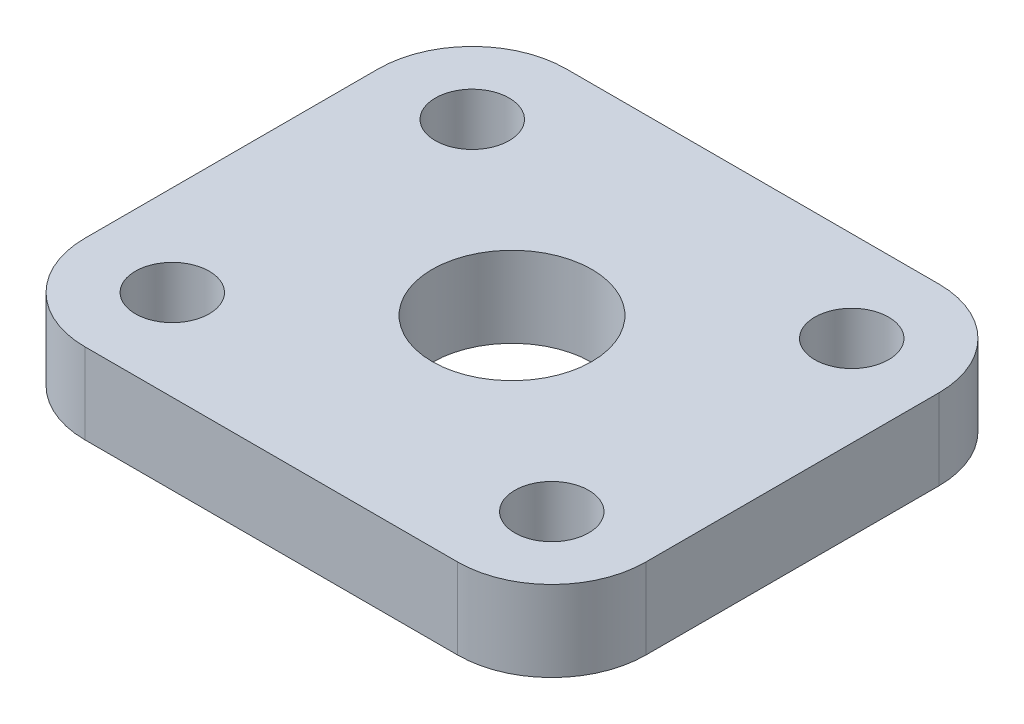
ISO-10303-21;
HEADER;
FILE_DESCRIPTION(('STEP AP214'),'2;1');
FILE_NAME('part.step','',(''),(''),'','','');
FILE_SCHEMA(('AUTOMOTIVE_DESIGN { 1 0 10303 214 1 1 1 1 }'));
ENDSEC;
DATA;
#1=APPLICATION_CONTEXT('core data for automotive mechanical design processes');
#2=APPLICATION_PROTOCOL_DEFINITION('international standard','automotive_design',2000,#1);
#3=PRODUCT_CONTEXT('',#1,'mechanical');
#4=PRODUCT('Part','Part','',(#3));
#5=PRODUCT_RELATED_PRODUCT_CATEGORY('part','',(#4));
#6=PRODUCT_DEFINITION_FORMATION('','',#4);
#7=PRODUCT_DEFINITION_CONTEXT('part definition',#1,'design');
#8=PRODUCT_DEFINITION('design','',#6,#7);
#9=PRODUCT_DEFINITION_SHAPE('','',#8);
#10=(LENGTH_UNIT() NAMED_UNIT(*) SI_UNIT(.MILLI.,.METRE.));
#11=(NAMED_UNIT(*) PLANE_ANGLE_UNIT() SI_UNIT($,.RADIAN.));
#12=(NAMED_UNIT(*) SI_UNIT($,.STERADIAN.) SOLID_ANGLE_UNIT());
#13=UNCERTAINTY_MEASURE_WITH_UNIT(LENGTH_MEASURE(1.E-05),#10,'distance_accuracy_value','');
#14=(GEOMETRIC_REPRESENTATION_CONTEXT(3) GLOBAL_UNCERTAINTY_ASSIGNED_CONTEXT((#13)) GLOBAL_UNIT_ASSIGNED_CONTEXT((#10,
#11,#12)) REPRESENTATION_CONTEXT('',''));
#15=CARTESIAN_POINT('',(0.,0.,0.));
#16=DIRECTION('',(0.,0.,1.));
#17=DIRECTION('',(1.,0.,0.));
#18=AXIS2_PLACEMENT_3D('',#15,#16,#17);
#19=CARTESIAN_POINT('',(20.8710849384369,-6.,0.));
#20=DIRECTION('',(1.,0.,0.));
#21=DIRECTION('',(0.,0.,-1.));
#22=AXIS2_PLACEMENT_3D('',#19,#20,#21);
#23=PLANE('',#22);
#24=DIRECTION('',(0.,0.,-1.));
#25=VECTOR('',#24,1.);
#26=CARTESIAN_POINT('',(20.8710849384369,-6.,0.));
#27=LINE('',#26,#25);
#28=CARTESIAN_POINT('',(20.8710849384369,-6.,10.9122112576967));
#29=VERTEX_POINT('',#28);
#30=CARTESIAN_POINT('',(20.8710849384369,-6.,-10.9122112576967));
#31=VERTEX_POINT('',#30);
#32=EDGE_CURVE('E11',#29,#31,#27,.T.);
#33=ORIENTED_EDGE('',*,*,#32,.T.);
#34=DIRECTION('',(0.,1.,0.));
#35=VECTOR('',#34,1.);
#36=CARTESIAN_POINT('',(20.8710849384369,-6.,-10.9122112576967));
#37=LINE('',#36,#35);
#38=CARTESIAN_POINT('',(20.8710849384369,0.,-10.9122112576967));
#39=VERTEX_POINT('',#38);
#40=EDGE_CURVE('E23',#31,#39,#37,.T.);
#41=ORIENTED_EDGE('',*,*,#40,.T.);
#42=DIRECTION('',(0.,0.,-1.));
#43=VECTOR('',#42,1.);
#44=CARTESIAN_POINT('',(20.8710849384369,0.,0.));
#45=LINE('',#44,#43);
#46=CARTESIAN_POINT('',(20.8710849384369,0.,10.9122112576967));
#47=VERTEX_POINT('',#46);
#48=EDGE_CURVE('E157',#47,#39,#45,.T.);
#49=ORIENTED_EDGE('',*,*,#48,.F.);
#50=DIRECTION('',(0.,1.,0.));
#51=VECTOR('',#50,1.);
#52=CARTESIAN_POINT('',(20.8710849384369,-6.,10.9122112576967));
#53=LINE('',#52,#51);
#54=EDGE_CURVE('E155',#47,#29,#53,.F.);
#55=ORIENTED_EDGE('',*,*,#54,.T.);
#56=EDGE_LOOP('',(#33,#41,#49,#55));
#57=FACE_BOUND('',#56,.T.);
#58=ADVANCED_FACE('F16',(#57),#23,.T.);
#59=CARTESIAN_POINT('',(0.,-6.,17.9122112576968));
#60=DIRECTION('',(0.,0.,-1.));
#61=DIRECTION('',(-1.,0.,0.));
#62=AXIS2_PLACEMENT_3D('',#59,#60,#61);
#63=PLANE('',#62);
#64=DIRECTION('',(-1.,0.,0.));
#65=VECTOR('',#64,1.);
#66=CARTESIAN_POINT('',(0.,-6.,17.9122112576968));
#67=LINE('',#66,#65);
#68=CARTESIAN_POINT('',(13.8710849384369,-6.,17.9122112576968));
#69=VERTEX_POINT('',#68);
#70=CARTESIAN_POINT('',(-13.8710849384369,-6.,17.9122112576968));
#71=VERTEX_POINT('',#70);
#72=EDGE_CURVE('E152',#69,#71,#67,.T.);
#73=ORIENTED_EDGE('',*,*,#72,.F.);
#74=DIRECTION('',(0.,1.,0.));
#75=VECTOR('',#74,1.);
#76=CARTESIAN_POINT('',(13.8710849384369,0.,17.9122112576968));
#77=LINE('',#76,#75);
#78=CARTESIAN_POINT('',(13.8710849384369,0.,17.9122112576968));
#79=VERTEX_POINT('',#78);
#80=EDGE_CURVE('E150',#69,#79,#77,.T.);
#81=ORIENTED_EDGE('',*,*,#80,.T.);
#82=DIRECTION('',(-1.,0.,0.));
#83=VECTOR('',#82,1.);
#84=CARTESIAN_POINT('',(0.,0.,17.9122112576968));
#85=LINE('',#84,#83);
#86=CARTESIAN_POINT('',(-13.8710849384369,0.,17.9122112576968));
#87=VERTEX_POINT('',#86);
#88=EDGE_CURVE('E148',#79,#87,#85,.T.);
#89=ORIENTED_EDGE('',*,*,#88,.T.);
#90=DIRECTION('',(0.,1.,0.));
#91=VECTOR('',#90,1.);
#92=CARTESIAN_POINT('',(-13.8710849384369,-6.,17.9122112576968));
#93=LINE('',#92,#91);
#94=EDGE_CURVE('E146',#87,#71,#93,.F.);
#95=ORIENTED_EDGE('',*,*,#94,.T.);
#96=EDGE_LOOP('',(#73,#81,#89,#95));
#97=FACE_BOUND('',#96,.T.);
#98=ADVANCED_FACE('F200',(#97),#63,.F.);
#99=CARTESIAN_POINT('',(-20.8710849384369,-6.,0.));
#100=DIRECTION('',(1.,0.,0.));
#101=DIRECTION('',(0.,0.,-1.));
#102=AXIS2_PLACEMENT_3D('',#99,#100,#101);
#103=PLANE('',#102);
#104=DIRECTION('',(0.,0.,-1.));
#105=VECTOR('',#104,1.);
#106=CARTESIAN_POINT('',(-20.8710849384369,0.,0.));
#107=LINE('',#106,#105);
#108=CARTESIAN_POINT('',(-20.8710849384369,0.,10.9122112576967));
#109=VERTEX_POINT('',#108);
#110=CARTESIAN_POINT('',(-20.8710849384369,0.,-10.9122112576967));
#111=VERTEX_POINT('',#110);
#112=EDGE_CURVE('E144',#109,#111,#107,.T.);
#113=ORIENTED_EDGE('',*,*,#112,.T.);
#114=DIRECTION('',(0.,1.,0.));
#115=VECTOR('',#114,1.);
#116=CARTESIAN_POINT('',(-20.8710849384369,-6.,-10.9122112576967));
#117=LINE('',#116,#115);
#118=CARTESIAN_POINT('',(-20.8710849384369,-6.,-10.9122112576967));
#119=VERTEX_POINT('',#118);
#120=EDGE_CURVE('E142',#111,#119,#117,.F.);
#121=ORIENTED_EDGE('',*,*,#120,.T.);
#122=DIRECTION('',(0.,0.,-1.));
#123=VECTOR('',#122,1.);
#124=CARTESIAN_POINT('',(-20.8710849384369,-6.,0.));
#125=LINE('',#124,#123);
#126=CARTESIAN_POINT('',(-20.8710849384369,-6.,10.9122112576967));
#127=VERTEX_POINT('',#126);
#128=EDGE_CURVE('E140',#127,#119,#125,.T.);
#129=ORIENTED_EDGE('',*,*,#128,.F.);
#130=DIRECTION('',(0.,1.,0.));
#131=VECTOR('',#130,1.);
#132=CARTESIAN_POINT('',(-20.8710849384369,-6.,10.9122112576967));
#133=LINE('',#132,#131);
#134=EDGE_CURVE('E138',#127,#109,#133,.T.);
#135=ORIENTED_EDGE('',*,*,#134,.T.);
#136=EDGE_LOOP('',(#113,#121,#129,#135));
#137=FACE_BOUND('',#136,.T.);
#138=ADVANCED_FACE('F184',(#137),#103,.F.);
#139=CARTESIAN_POINT('',(-14.1210849384369,-6.,-11.1622112576967));
#140=DIRECTION('',(0.,1.,0.));
#141=DIRECTION('',(0.,0.,1.));
#142=AXIS2_PLACEMENT_3D('',#139,#140,#141);
#143=CYLINDRICAL_SURFACE('',#142,2.75);
#144=CARTESIAN_POINT('',(-14.1210849384369,-6.,-11.1622112576967));
#145=DIRECTION('',(0.,-1.,0.));
#146=DIRECTION('',(0.,0.,-1.));
#147=AXIS2_PLACEMENT_3D('',#144,#145,#146);
#148=CIRCLE('',#147,2.75);
#149=CARTESIAN_POINT('',(-14.1210849384369,-6.,-13.9122112576967));
#150=VERTEX_POINT('',#149);
#151=EDGE_CURVE('E135',#150,#150,#148,.T.);
#152=ORIENTED_EDGE('',*,*,#151,.T.);
#153=EDGE_LOOP('',(#152));
#154=FACE_BOUND('',#153,.T.);
#155=CARTESIAN_POINT('',(-14.1210849384369,0.,-11.1622112576967));
#156=DIRECTION('',(0.,-1.,0.));
#157=DIRECTION('',(0.,0.,-1.));
#158=AXIS2_PLACEMENT_3D('',#155,#156,#157);
#159=CIRCLE('',#158,2.75);
#160=CARTESIAN_POINT('',(-14.1210849384369,0.,-13.9122112576967));
#161=VERTEX_POINT('',#160);
#162=EDGE_CURVE('E132',#161,#161,#159,.T.);
#163=ORIENTED_EDGE('',*,*,#162,.F.);
#164=EDGE_LOOP('',(#163));
#165=FACE_BOUND('',#164,.T.);
#166=ADVANCED_FACE('F208',(#154,#165),#143,.F.);
#167=CARTESIAN_POINT('',(-14.1210849384369,-6.,11.1622112576967));
#168=DIRECTION('',(0.,1.,0.));
#169=DIRECTION('',(0.,0.,1.));
#170=AXIS2_PLACEMENT_3D('',#167,#168,#169);
#171=CYLINDRICAL_SURFACE('',#170,2.75);
#172=CARTESIAN_POINT('',(-14.1210849384369,-6.,11.1622112576967));
#173=DIRECTION('',(0.,1.,0.));
#174=DIRECTION('',(0.,0.,-1.));
#175=AXIS2_PLACEMENT_3D('',#172,#173,#174);
#176=CIRCLE('',#175,2.75);
#177=CARTESIAN_POINT('',(-14.1210849384369,-6.,8.41221125769674));
#178=VERTEX_POINT('',#177);
#179=EDGE_CURVE('E129',#178,#178,#176,.T.);
#180=ORIENTED_EDGE('',*,*,#179,.F.);
#181=EDGE_LOOP('',(#180));
#182=FACE_BOUND('',#181,.T.);
#183=CARTESIAN_POINT('',(-14.1210849384369,0.,11.1622112576967));
#184=DIRECTION('',(0.,1.,0.));
#185=DIRECTION('',(0.,0.,-1.));
#186=AXIS2_PLACEMENT_3D('',#183,#184,#185);
#187=CIRCLE('',#186,2.75);
#188=CARTESIAN_POINT('',(-14.1210849384369,0.,8.41221125769674));
#189=VERTEX_POINT('',#188);
#190=EDGE_CURVE('E126',#189,#189,#187,.T.);
#191=ORIENTED_EDGE('',*,*,#190,.T.);
#192=EDGE_LOOP('',(#191));
#193=FACE_BOUND('',#192,.T.);
#194=ADVANCED_FACE('F213',(#182,#193),#171,.F.);
#195=CARTESIAN_POINT('',(0.,-6.,0.));
#196=DIRECTION('',(0.,1.,0.));
#197=DIRECTION('',(0.,0.,1.));
#198=AXIS2_PLACEMENT_3D('',#195,#196,#197);
#199=CYLINDRICAL_SURFACE('',#198,5.945);
#200=CARTESIAN_POINT('',(0.,-6.,0.));
#201=DIRECTION('',(0.,-1.,0.));
#202=DIRECTION('',(0.,0.,-1.));
#203=AXIS2_PLACEMENT_3D('',#200,#201,#202);
#204=CIRCLE('',#203,5.945);
#205=CARTESIAN_POINT('',(0.,-6.,-5.945));
#206=VERTEX_POINT('',#205);
#207=EDGE_CURVE('E123',#206,#206,#204,.T.);
#208=ORIENTED_EDGE('',*,*,#207,.T.);
#209=EDGE_LOOP('',(#208));
#210=FACE_BOUND('',#209,.T.);
#211=CARTESIAN_POINT('',(0.,0.,0.));
#212=DIRECTION('',(0.,-1.,0.));
#213=DIRECTION('',(0.,0.,-1.));
#214=AXIS2_PLACEMENT_3D('',#211,#212,#213);
#215=CIRCLE('',#214,5.945);
#216=CARTESIAN_POINT('',(0.,0.,-5.945));
#217=VERTEX_POINT('',#216);
#218=EDGE_CURVE('E120',#217,#217,#215,.T.);
#219=ORIENTED_EDGE('',*,*,#218,.F.);
#220=EDGE_LOOP('',(#219));
#221=FACE_BOUND('',#220,.T.);
#222=ADVANCED_FACE('F217',(#210,#221),#199,.F.);
#223=CARTESIAN_POINT('',(14.1210849384369,-6.,11.1622112576967));
#224=DIRECTION('',(0.,1.,0.));
#225=DIRECTION('',(0.,0.,1.));
#226=AXIS2_PLACEMENT_3D('',#223,#224,#225);
#227=CYLINDRICAL_SURFACE('',#226,2.75);
#228=CARTESIAN_POINT('',(14.1210849384369,-6.,11.1622112576967));
#229=DIRECTION('',(0.,-1.,0.));
#230=DIRECTION('',(0.,0.,-1.));
#231=AXIS2_PLACEMENT_3D('',#228,#229,#230);
#232=CIRCLE('',#231,2.75);
#233=CARTESIAN_POINT('',(14.1210849384369,-6.,8.41221125769674));
#234=VERTEX_POINT('',#233);
#235=EDGE_CURVE('E117',#234,#234,#232,.T.);
#236=ORIENTED_EDGE('',*,*,#235,.T.);
#237=EDGE_LOOP('',(#236));
#238=FACE_BOUND('',#237,.T.);
#239=CARTESIAN_POINT('',(14.1210849384369,0.,11.1622112576967));
#240=DIRECTION('',(0.,-1.,0.));
#241=DIRECTION('',(0.,0.,-1.));
#242=AXIS2_PLACEMENT_3D('',#239,#240,#241);
#243=CIRCLE('',#242,2.75);
#244=CARTESIAN_POINT('',(14.1210849384369,0.,8.41221125769674));
#245=VERTEX_POINT('',#244);
#246=EDGE_CURVE('E96',#245,#245,#243,.T.);
#247=ORIENTED_EDGE('',*,*,#246,.F.);
#248=EDGE_LOOP('',(#247));
#249=FACE_BOUND('',#248,.T.);
#250=ADVANCED_FACE('F221',(#238,#249),#227,.F.);
#251=CARTESIAN_POINT('',(0.,-6.,-17.9122112576968));
#252=DIRECTION('',(0.,0.,-1.));
#253=DIRECTION('',(-1.,0.,0.));
#254=AXIS2_PLACEMENT_3D('',#251,#252,#253);
#255=PLANE('',#254);
#256=DIRECTION('',(-1.,0.,0.));
#257=VECTOR('',#256,1.);
#258=CARTESIAN_POINT('',(0.,-6.,-17.9122112576968));
#259=LINE('',#258,#257);
#260=CARTESIAN_POINT('',(13.8710849384369,-6.,-17.9122112576968));
#261=VERTEX_POINT('',#260);
#262=CARTESIAN_POINT('',(-13.8710849384369,-6.,-17.9122112576968));
#263=VERTEX_POINT('',#262);
#264=EDGE_CURVE('E78',#261,#263,#259,.T.);
#265=ORIENTED_EDGE('',*,*,#264,.T.);
#266=DIRECTION('',(0.,1.,0.));
#267=VECTOR('',#266,1.);
#268=CARTESIAN_POINT('',(-13.8710849384369,0.,-17.9122112576968));
#269=LINE('',#268,#267);
#270=CARTESIAN_POINT('',(-13.8710849384369,0.,-17.9122112576968));
#271=VERTEX_POINT('',#270);
#272=EDGE_CURVE('E97',#263,#271,#269,.T.);
#273=ORIENTED_EDGE('',*,*,#272,.T.);
#274=DIRECTION('',(-1.,0.,0.));
#275=VECTOR('',#274,1.);
#276=CARTESIAN_POINT('',(0.,0.,-17.9122112576968));
#277=LINE('',#276,#275);
#278=CARTESIAN_POINT('',(13.8710849384369,0.,-17.9122112576968));
#279=VERTEX_POINT('',#278);
#280=EDGE_CURVE('E81',#279,#271,#277,.T.);
#281=ORIENTED_EDGE('',*,*,#280,.F.);
#282=DIRECTION('',(0.,1.,0.));
#283=VECTOR('',#282,1.);
#284=CARTESIAN_POINT('',(13.8710849384369,-6.,-17.9122112576968));
#285=LINE('',#284,#283);
#286=EDGE_CURVE('E75',#279,#261,#285,.F.);
#287=ORIENTED_EDGE('',*,*,#286,.T.);
#288=EDGE_LOOP('',(#265,#273,#281,#287));
#289=FACE_BOUND('',#288,.T.);
#290=ADVANCED_FACE('F77',(#289),#255,.T.);
#291=CARTESIAN_POINT('',(14.1210849384369,-6.,-11.1622112576967));
#292=DIRECTION('',(0.,1.,0.));
#293=DIRECTION('',(0.,0.,1.));
#294=AXIS2_PLACEMENT_3D('',#291,#292,#293);
#295=CYLINDRICAL_SURFACE('',#294,2.75);
#296=CARTESIAN_POINT('',(14.1210849384369,-6.,-11.1622112576967));
#297=DIRECTION('',(0.,1.,0.));
#298=DIRECTION('',(0.,0.,-1.));
#299=AXIS2_PLACEMENT_3D('',#296,#297,#298);
#300=CIRCLE('',#299,2.75);
#301=CARTESIAN_POINT('',(14.1210849384369,-6.,-13.9122112576967));
#302=VERTEX_POINT('',#301);
#303=EDGE_CURVE('E86',#302,#302,#300,.T.);
#304=ORIENTED_EDGE('',*,*,#303,.F.);
#305=EDGE_LOOP('',(#304));
#306=FACE_BOUND('',#305,.T.);
#307=CARTESIAN_POINT('',(14.1210849384369,0.,-11.1622112576967));
#308=DIRECTION('',(0.,1.,0.));
#309=DIRECTION('',(0.,0.,-1.));
#310=AXIS2_PLACEMENT_3D('',#307,#308,#309);
#311=CIRCLE('',#310,2.75);
#312=CARTESIAN_POINT('',(14.1210849384369,0.,-13.9122112576967));
#313=VERTEX_POINT('',#312);
#314=EDGE_CURVE('E102',#313,#313,#311,.T.);
#315=ORIENTED_EDGE('',*,*,#314,.T.);
#316=EDGE_LOOP('',(#315));
#317=FACE_BOUND('',#316,.T.);
#318=ADVANCED_FACE('F228',(#306,#317),#295,.F.);
#319=CARTESIAN_POINT('',(0.,-6.,0.));
#320=DIRECTION('',(0.,-1.,0.));
#321=DIRECTION('',(1.,0.,0.));
#322=AXIS2_PLACEMENT_3D('',#319,#320,#321);
#323=PLANE('',#322);
#324=ORIENTED_EDGE('',*,*,#128,.T.);
#325=CARTESIAN_POINT('',(-13.8710849384369,-6.,-10.9122112576967));
#326=DIRECTION('',(0.,-1.,0.));
#327=DIRECTION('',(0.,0.,-1.));
#328=AXIS2_PLACEMENT_3D('',#325,#326,#327);
#329=CIRCLE('',#328,7.);
#330=EDGE_CURVE('E94',#119,#263,#329,.T.);
#331=ORIENTED_EDGE('',*,*,#330,.T.);
#332=ORIENTED_EDGE('',*,*,#264,.F.);
#333=CARTESIAN_POINT('',(13.8710849384369,-6.,-10.9122112576967));
#334=DIRECTION('',(0.,-1.,0.));
#335=DIRECTION('',(0.,0.,-1.));
#336=AXIS2_PLACEMENT_3D('',#333,#334,#335);
#337=CIRCLE('',#336,7.);
#338=EDGE_CURVE('E92',#261,#31,#337,.T.);
#339=ORIENTED_EDGE('',*,*,#338,.T.);
#340=ORIENTED_EDGE('',*,*,#32,.F.);
#341=CARTESIAN_POINT('',(13.8710849384369,-6.,10.9122112576967));
#342=DIRECTION('',(0.,-1.,0.));
#343=DIRECTION('',(0.,0.,-1.));
#344=AXIS2_PLACEMENT_3D('',#341,#342,#343);
#345=CIRCLE('',#344,7.);
#346=EDGE_CURVE('E100',#29,#69,#345,.T.);
#347=ORIENTED_EDGE('',*,*,#346,.T.);
#348=ORIENTED_EDGE('',*,*,#72,.T.);
#349=CARTESIAN_POINT('',(-13.8710849384369,-6.,10.9122112576967));
#350=DIRECTION('',(0.,-1.,0.));
#351=DIRECTION('',(0.,0.,-1.));
#352=AXIS2_PLACEMENT_3D('',#349,#350,#351);
#353=CIRCLE('',#352,7.);
#354=EDGE_CURVE('E105',#71,#127,#353,.T.);
#355=ORIENTED_EDGE('',*,*,#354,.T.);
#356=EDGE_LOOP('',(#324,#331,#332,#339,#340,#347,#348,#355));
#357=FACE_BOUND('',#356,.T.);
#358=ORIENTED_EDGE('',*,*,#235,.F.);
#359=EDGE_LOOP('',(#358));
#360=FACE_BOUND('',#359,.T.);
#361=ORIENTED_EDGE('',*,*,#207,.F.);
#362=EDGE_LOOP('',(#361));
#363=FACE_BOUND('',#362,.T.);
#364=ORIENTED_EDGE('',*,*,#179,.T.);
#365=EDGE_LOOP('',(#364));
#366=FACE_BOUND('',#365,.T.);
#367=ORIENTED_EDGE('',*,*,#151,.F.);
#368=EDGE_LOOP('',(#367));
#369=FACE_BOUND('',#368,.T.);
#370=ORIENTED_EDGE('',*,*,#303,.T.);
#371=EDGE_LOOP('',(#370));
#372=FACE_BOUND('',#371,.T.);
#373=ADVANCED_FACE('F90',(#357,#360,#363,#366,#369,#372),#323,.T.);
#374=CARTESIAN_POINT('',(0.,0.,0.));
#375=DIRECTION('',(0.,-1.,0.));
#376=DIRECTION('',(1.,0.,0.));
#377=AXIS2_PLACEMENT_3D('',#374,#375,#376);
#378=PLANE('',#377);
#379=ORIENTED_EDGE('',*,*,#280,.T.);
#380=CARTESIAN_POINT('',(-13.8710849384369,0.,-10.9122112576967));
#381=DIRECTION('',(0.,-1.,0.));
#382=DIRECTION('',(0.,0.,-1.));
#383=AXIS2_PLACEMENT_3D('',#380,#381,#382);
#384=CIRCLE('',#383,7.);
#385=EDGE_CURVE('E173',#271,#111,#384,.F.);
#386=ORIENTED_EDGE('',*,*,#385,.T.);
#387=ORIENTED_EDGE('',*,*,#112,.F.);
#388=CARTESIAN_POINT('',(-13.8710849384369,0.,10.9122112576967));
#389=DIRECTION('',(0.,-1.,0.));
#390=DIRECTION('',(0.,0.,-1.));
#391=AXIS2_PLACEMENT_3D('',#388,#389,#390);
#392=CIRCLE('',#391,7.);
#393=EDGE_CURVE('E168',#109,#87,#392,.F.);
#394=ORIENTED_EDGE('',*,*,#393,.T.);
#395=ORIENTED_EDGE('',*,*,#88,.F.);
#396=CARTESIAN_POINT('',(13.8710849384369,0.,10.9122112576967));
#397=DIRECTION('',(0.,-1.,0.));
#398=DIRECTION('',(0.,0.,-1.));
#399=AXIS2_PLACEMENT_3D('',#396,#397,#398);
#400=CIRCLE('',#399,7.);
#401=EDGE_CURVE('E165',#79,#47,#400,.F.);
#402=ORIENTED_EDGE('',*,*,#401,.T.);
#403=ORIENTED_EDGE('',*,*,#48,.T.);
#404=CARTESIAN_POINT('',(13.8710849384369,0.,-10.9122112576967));
#405=DIRECTION('',(0.,-1.,0.));
#406=DIRECTION('',(0.,0.,-1.));
#407=AXIS2_PLACEMENT_3D('',#404,#405,#406);
#408=CIRCLE('',#407,7.);
#409=EDGE_CURVE('E162',#39,#279,#408,.F.);
#410=ORIENTED_EDGE('',*,*,#409,.T.);
#411=EDGE_LOOP('',(#379,#386,#387,#394,#395,#402,#403,#410));
#412=FACE_BOUND('',#411,.T.);
#413=ORIENTED_EDGE('',*,*,#246,.T.);
#414=EDGE_LOOP('',(#413));
#415=FACE_BOUND('',#414,.T.);
#416=ORIENTED_EDGE('',*,*,#218,.T.);
#417=EDGE_LOOP('',(#416));
#418=FACE_BOUND('',#417,.T.);
#419=ORIENTED_EDGE('',*,*,#190,.F.);
#420=EDGE_LOOP('',(#419));
#421=FACE_BOUND('',#420,.T.);
#422=ORIENTED_EDGE('',*,*,#162,.T.);
#423=EDGE_LOOP('',(#422));
#424=FACE_BOUND('',#423,.T.);
#425=ORIENTED_EDGE('',*,*,#314,.F.);
#426=EDGE_LOOP('',(#425));
#427=FACE_BOUND('',#426,.T.);
#428=ADVANCED_FACE('F160',(#412,#415,#418,#421,#424,#427),#378,.F.);
#429=CARTESIAN_POINT('',(-13.8710849384369,-6.,-10.9122112576967));
#430=DIRECTION('',(0.,-1.,0.));
#431=DIRECTION('',(0.,0.,-1.));
#432=AXIS2_PLACEMENT_3D('',#429,#430,#431);
#433=CYLINDRICAL_SURFACE('',#432,7.);
#434=ORIENTED_EDGE('',*,*,#330,.F.);
#435=ORIENTED_EDGE('',*,*,#120,.F.);
#436=ORIENTED_EDGE('',*,*,#385,.F.);
#437=ORIENTED_EDGE('',*,*,#272,.F.);
#438=EDGE_LOOP('',(#434,#435,#436,#437));
#439=FACE_BOUND('',#438,.T.);
#440=ADVANCED_FACE('F188',(#439),#433,.T.);
#441=CARTESIAN_POINT('',(13.8710849384369,-6.,-10.9122112576967));
#442=DIRECTION('',(0.,1.,0.));
#443=DIRECTION('',(0.,0.,1.));
#444=AXIS2_PLACEMENT_3D('',#441,#442,#443);
#445=CYLINDRICAL_SURFACE('',#444,7.);
#446=ORIENTED_EDGE('',*,*,#338,.F.);
#447=ORIENTED_EDGE('',*,*,#286,.F.);
#448=ORIENTED_EDGE('',*,*,#409,.F.);
#449=ORIENTED_EDGE('',*,*,#40,.F.);
#450=EDGE_LOOP('',(#446,#447,#448,#449));
#451=FACE_BOUND('',#450,.T.);
#452=ADVANCED_FACE('F99',(#451),#445,.T.);
#453=CARTESIAN_POINT('',(13.8710849384369,-6.,10.9122112576967));
#454=DIRECTION('',(0.,-1.,0.));
#455=DIRECTION('',(0.,0.,-1.));
#456=AXIS2_PLACEMENT_3D('',#453,#454,#455);
#457=CYLINDRICAL_SURFACE('',#456,7.);
#458=ORIENTED_EDGE('',*,*,#346,.F.);
#459=ORIENTED_EDGE('',*,*,#54,.F.);
#460=ORIENTED_EDGE('',*,*,#401,.F.);
#461=ORIENTED_EDGE('',*,*,#80,.F.);
#462=EDGE_LOOP('',(#458,#459,#460,#461));
#463=FACE_BOUND('',#462,.T.);
#464=ADVANCED_FACE('F196',(#463),#457,.T.);
#465=CARTESIAN_POINT('',(-13.8710849384369,-6.,10.9122112576967));
#466=DIRECTION('',(0.,1.,0.));
#467=DIRECTION('',(0.,0.,1.));
#468=AXIS2_PLACEMENT_3D('',#465,#466,#467);
#469=CYLINDRICAL_SURFACE('',#468,7.);
#470=ORIENTED_EDGE('',*,*,#354,.F.);
#471=ORIENTED_EDGE('',*,*,#94,.F.);
#472=ORIENTED_EDGE('',*,*,#393,.F.);
#473=ORIENTED_EDGE('',*,*,#134,.F.);
#474=EDGE_LOOP('',(#470,#471,#472,#473));
#475=FACE_BOUND('',#474,.T.);
#476=ADVANCED_FACE('F181',(#475),#469,.T.);
#477=CLOSED_SHELL('',(#58,#98,#138,#166,#194,#222,#250,#290,#318,#373,#428,#440,#452,#464,#476));
#478=MANIFOLD_SOLID_BREP('B1',#477);
#479=ADVANCED_BREP_SHAPE_REPRESENTATION('',(#18,#478),#14);
#480=SHAPE_DEFINITION_REPRESENTATION(#9,#479);
ENDSEC;
END-ISO-10303-21;
